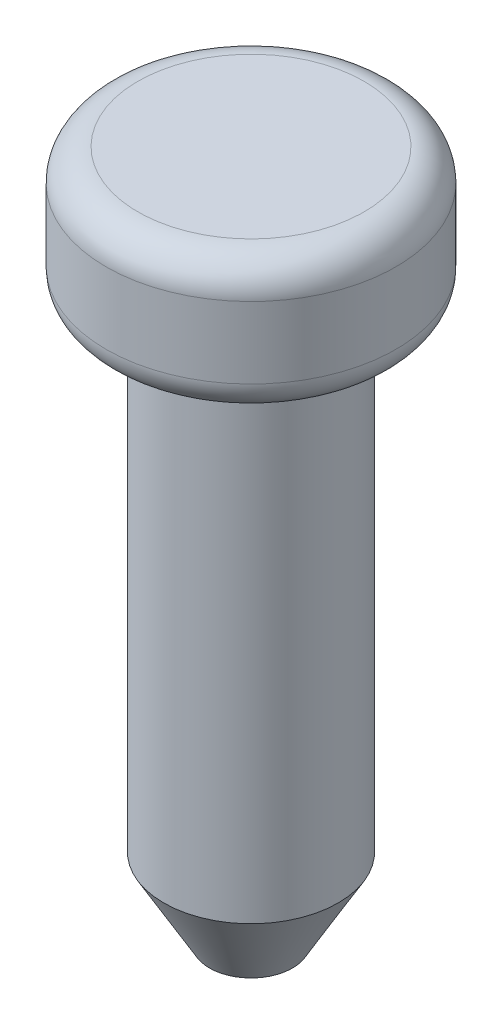
ISO-10303-21;
HEADER;
FILE_DESCRIPTION(('STEP AP214'),'2;1');
FILE_NAME('part.step','',(''),(''),'','','');
FILE_SCHEMA(('AUTOMOTIVE_DESIGN { 1 0 10303 214 1 1 1 1 }'));
ENDSEC;
DATA;
#1=APPLICATION_CONTEXT('core data for automotive mechanical design processes');
#2=APPLICATION_PROTOCOL_DEFINITION('international standard','automotive_design',2000,#1);
#3=PRODUCT_CONTEXT('',#1,'mechanical');
#4=PRODUCT('Part','Part','',(#3));
#5=PRODUCT_RELATED_PRODUCT_CATEGORY('part','',(#4));
#6=PRODUCT_DEFINITION_FORMATION('','',#4);
#7=PRODUCT_DEFINITION_CONTEXT('part definition',#1,'design');
#8=PRODUCT_DEFINITION('design','',#6,#7);
#9=PRODUCT_DEFINITION_SHAPE('','',#8);
#10=(LENGTH_UNIT() NAMED_UNIT(*) SI_UNIT(.MILLI.,.METRE.));
#11=(NAMED_UNIT(*) PLANE_ANGLE_UNIT() SI_UNIT($,.RADIAN.));
#12=(NAMED_UNIT(*) SI_UNIT($,.STERADIAN.) SOLID_ANGLE_UNIT());
#13=UNCERTAINTY_MEASURE_WITH_UNIT(LENGTH_MEASURE(1.E-05),#10,'distance_accuracy_value','');
#14=(GEOMETRIC_REPRESENTATION_CONTEXT(3) GLOBAL_UNCERTAINTY_ASSIGNED_CONTEXT((#13)) GLOBAL_UNIT_ASSIGNED_CONTEXT((#10,
#11,#12)) REPRESENTATION_CONTEXT('',''));
#15=CARTESIAN_POINT('',(0.,0.,0.));
#16=DIRECTION('',(0.,0.,1.));
#17=DIRECTION('',(1.,0.,0.));
#18=AXIS2_PLACEMENT_3D('',#15,#16,#17);
#19=CARTESIAN_POINT('',(-1.1,0.,0.));
#20=DIRECTION('',(0.,1.,0.));
#21=DIRECTION('',(0.,0.,1.));
#22=AXIS2_PLACEMENT_3D('',#19,#20,#21);
#23=PLANE('',#22);
#24=CARTESIAN_POINT('',(0.,0.,0.));
#25=DIRECTION('',(0.,1.,0.));
#26=DIRECTION('',(0.,0.,1.));
#27=AXIS2_PLACEMENT_3D('',#24,#25,#26);
#28=CIRCLE('',#27,0.522649730810373);
#29=CARTESIAN_POINT('',(0.,0.,0.522649730810373));
#30=VERTEX_POINT('',#29);
#31=EDGE_CURVE('E41',#30,#30,#28,.F.);
#32=ORIENTED_EDGE('',*,*,#31,.T.);
#33=EDGE_LOOP('',(#32));
#34=FACE_BOUND('',#33,.T.);
#35=ADVANCED_FACE('F33',(#34),#23,.F.);
#36=CARTESIAN_POINT('',(0.,8.7,0.));
#37=DIRECTION('',(0.,-1.,0.));
#38=DIRECTION('',(0.,0.,-1.));
#39=AXIS2_PLACEMENT_3D('',#36,#37,#38);
#40=PLANE('',#39);
#41=CARTESIAN_POINT('',(0.,8.7,0.));
#42=DIRECTION('',(0.,-1.,0.));
#43=DIRECTION('',(0.,0.,-1.));
#44=AXIS2_PLACEMENT_3D('',#41,#42,#43);
#45=CIRCLE('',#44,1.425);
#46=CARTESIAN_POINT('',(0.,8.7,-1.425));
#47=VERTEX_POINT('',#46);
#48=EDGE_CURVE('E45',#47,#47,#45,.F.);
#49=ORIENTED_EDGE('',*,*,#48,.T.);
#50=EDGE_LOOP('',(#49));
#51=FACE_BOUND('',#50,.T.);
#52=ADVANCED_FACE('F77',(#51),#40,.F.);
#53=CARTESIAN_POINT('',(0.,0.,0.));
#54=DIRECTION('',(0.,-1.,0.));
#55=DIRECTION('',(0.,0.,-1.));
#56=AXIS2_PLACEMENT_3D('',#53,#54,#55);
#57=CYLINDRICAL_SURFACE('',#56,1.825);
#58=CARTESIAN_POINT('',(0.,7.4,0.));
#59=DIRECTION('',(0.,1.,0.));
#60=DIRECTION('',(0.,0.,1.));
#61=AXIS2_PLACEMENT_3D('',#58,#59,#60);
#62=CIRCLE('',#61,1.825);
#63=CARTESIAN_POINT('',(0.,7.4,1.825));
#64=VERTEX_POINT('',#63);
#65=EDGE_CURVE('E49',#64,#64,#62,.T.);
#66=ORIENTED_EDGE('',*,*,#65,.T.);
#67=EDGE_LOOP('',(#66));
#68=FACE_BOUND('',#67,.T.);
#69=CARTESIAN_POINT('',(0.,8.3,0.));
#70=DIRECTION('',(0.,-1.,0.));
#71=DIRECTION('',(0.,0.,-1.));
#72=AXIS2_PLACEMENT_3D('',#69,#70,#71);
#73=CIRCLE('',#72,1.825);
#74=CARTESIAN_POINT('',(0.,8.3,-1.825));
#75=VERTEX_POINT('',#74);
#76=EDGE_CURVE('E54',#75,#75,#73,.T.);
#77=ORIENTED_EDGE('',*,*,#76,.T.);
#78=EDGE_LOOP('',(#77));
#79=FACE_BOUND('',#78,.T.);
#80=ADVANCED_FACE('F68',(#68,#79),#57,.T.);
#81=CARTESIAN_POINT('',(-1.825,7.,0.));
#82=DIRECTION('',(0.,1.,0.));
#83=DIRECTION('',(0.,0.,1.));
#84=AXIS2_PLACEMENT_3D('',#81,#82,#83);
#85=PLANE('',#84);
#86=CARTESIAN_POINT('',(0.,7.,0.));
#87=DIRECTION('',(0.,1.,0.));
#88=DIRECTION('',(0.,0.,1.));
#89=AXIS2_PLACEMENT_3D('',#86,#87,#88);
#90=CIRCLE('',#89,1.425);
#91=CARTESIAN_POINT('',(0.,7.,1.425));
#92=VERTEX_POINT('',#91);
#93=EDGE_CURVE('E57',#92,#92,#90,.F.);
#94=ORIENTED_EDGE('',*,*,#93,.T.);
#95=EDGE_LOOP('',(#94));
#96=FACE_BOUND('',#95,.T.);
#97=CARTESIAN_POINT('',(0.,7.,0.));
#98=DIRECTION('',(0.,-1.,0.));
#99=DIRECTION('',(0.,0.,-1.));
#100=AXIS2_PLACEMENT_3D('',#97,#98,#99);
#101=CIRCLE('',#100,1.1);
#102=CARTESIAN_POINT('',(0.,7.,-1.1));
#103=VERTEX_POINT('',#102);
#104=EDGE_CURVE('E60',#103,#103,#101,.T.);
#105=ORIENTED_EDGE('',*,*,#104,.F.);
#106=EDGE_LOOP('',(#105));
#107=FACE_BOUND('',#106,.T.);
#108=ADVANCED_FACE('F66',(#96,#107),#85,.F.);
#109=CARTESIAN_POINT('',(0.,0.,0.));
#110=DIRECTION('',(0.,-1.,0.));
#111=DIRECTION('',(0.,0.,-1.));
#112=AXIS2_PLACEMENT_3D('',#109,#110,#111);
#113=CYLINDRICAL_SURFACE('',#112,1.1);
#114=CARTESIAN_POINT('',(0.,1.00000000000001,0.));
#115=DIRECTION('',(0.,1.,0.));
#116=DIRECTION('',(0.,0.,1.));
#117=AXIS2_PLACEMENT_3D('',#114,#115,#116);
#118=CIRCLE('',#117,1.1);
#119=CARTESIAN_POINT('',(0.,1.00000000000001,1.1));
#120=VERTEX_POINT('',#119);
#121=EDGE_CURVE('E10',#120,#120,#118,.T.);
#122=ORIENTED_EDGE('',*,*,#121,.T.);
#123=EDGE_LOOP('',(#122));
#124=FACE_BOUND('',#123,.T.);
#125=ORIENTED_EDGE('',*,*,#104,.T.);
#126=EDGE_LOOP('',(#125));
#127=FACE_BOUND('',#126,.T.);
#128=ADVANCED_FACE('F64',(#124,#127),#113,.T.);
#129=CARTESIAN_POINT('',(0.,7.4,0.));
#130=DIRECTION('',(0.,1.,0.));
#131=DIRECTION('',(0.,0.,1.));
#132=AXIS2_PLACEMENT_3D('',#129,#130,#131);
#133=TOROIDAL_SURFACE('',#132,1.425,0.4);
#134=ORIENTED_EDGE('',*,*,#65,.F.);
#135=EDGE_LOOP('',(#134));
#136=FACE_BOUND('',#135,.T.);
#137=ORIENTED_EDGE('',*,*,#93,.F.);
#138=EDGE_LOOP('',(#137));
#139=FACE_BOUND('',#138,.T.);
#140=ADVANCED_FACE('F75',(#136,#139),#133,.T.);
#141=CARTESIAN_POINT('',(0.,8.3,0.));
#142=DIRECTION('',(0.,-1.,0.));
#143=DIRECTION('',(0.,0.,-1.));
#144=AXIS2_PLACEMENT_3D('',#141,#142,#143);
#145=TOROIDAL_SURFACE('',#144,1.425,0.4);
#146=ORIENTED_EDGE('',*,*,#48,.F.);
#147=EDGE_LOOP('',(#146));
#148=FACE_BOUND('',#147,.T.);
#149=ORIENTED_EDGE('',*,*,#76,.F.);
#150=EDGE_LOOP('',(#149));
#151=FACE_BOUND('',#150,.T.);
#152=ADVANCED_FACE('F89',(#148,#151),#145,.T.);
#153=CARTESIAN_POINT('',(0.,0.,0.));
#154=DIRECTION('',(0.,1.,0.));
#155=DIRECTION('',(0.,0.,1.));
#156=AXIS2_PLACEMENT_3D('',#153,#154,#155);
#157=CONICAL_SURFACE('',#156,0.522649730810373,0.523598775598296);
#158=ORIENTED_EDGE('',*,*,#121,.F.);
#159=EDGE_LOOP('',(#158));
#160=FACE_BOUND('',#159,.T.);
#161=ORIENTED_EDGE('',*,*,#31,.F.);
#162=EDGE_LOOP('',(#161));
#163=FACE_BOUND('',#162,.T.);
#164=ADVANCED_FACE('F36',(#160,#163),#157,.T.);
#165=CLOSED_SHELL('',(#35,#52,#80,#108,#128,#140,#152,#164));
#166=MANIFOLD_SOLID_BREP('B2',#165);
#167=ADVANCED_BREP_SHAPE_REPRESENTATION('',(#18,#166),#14);
#168=SHAPE_DEFINITION_REPRESENTATION(#9,#167);
ENDSEC;
END-ISO-10303-21;
